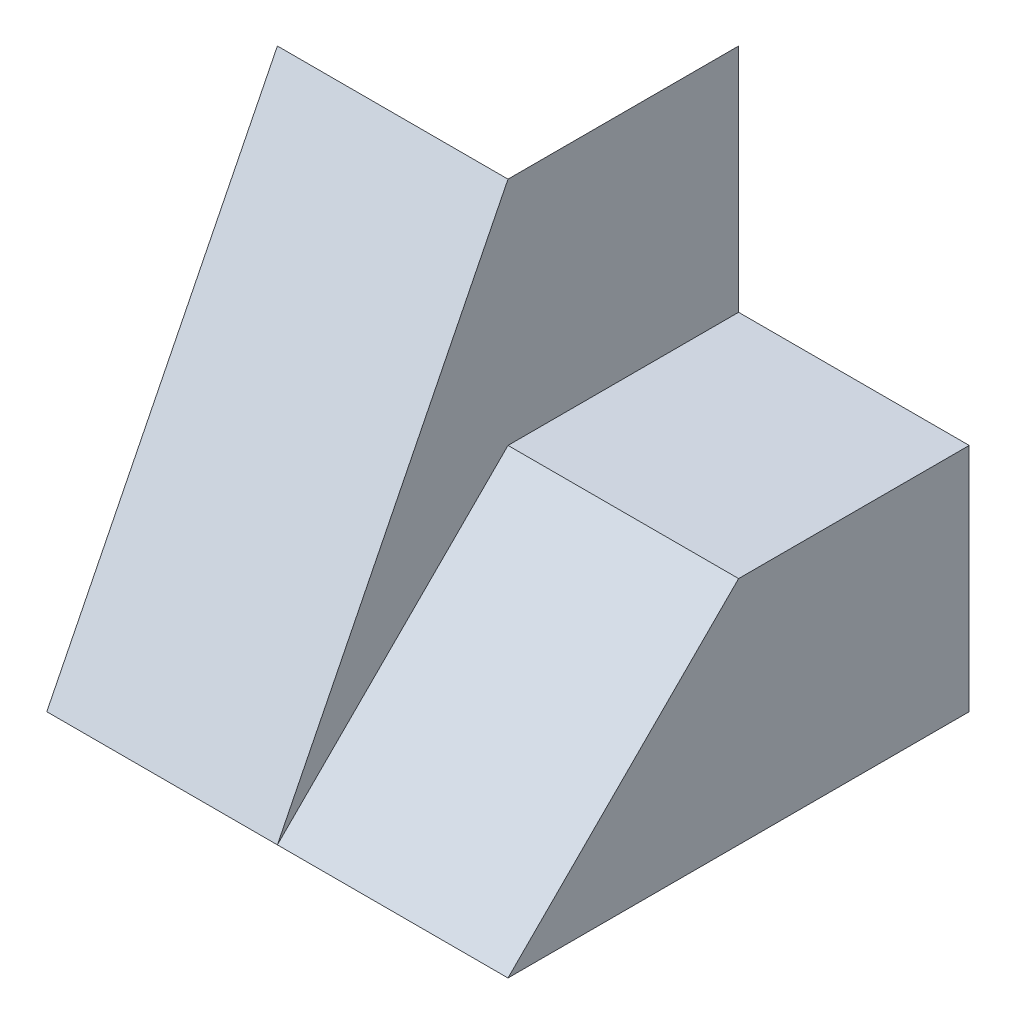
ISO-10303-21;
HEADER;
FILE_DESCRIPTION(('STEP AP214'),'2;1');
FILE_NAME('part.step','',(''),(''),'','','');
FILE_SCHEMA(('AUTOMOTIVE_DESIGN { 1 0 10303 214 1 1 1 1 }'));
ENDSEC;
DATA;
#1=APPLICATION_CONTEXT('core data for automotive mechanical design processes');
#2=APPLICATION_PROTOCOL_DEFINITION('international standard','automotive_design',2000,#1);
#3=PRODUCT_CONTEXT('',#1,'mechanical');
#4=PRODUCT('Part','Part','',(#3));
#5=PRODUCT_RELATED_PRODUCT_CATEGORY('part','',(#4));
#6=PRODUCT_DEFINITION_FORMATION('','',#4);
#7=PRODUCT_DEFINITION_CONTEXT('part definition',#1,'design');
#8=PRODUCT_DEFINITION('design','',#6,#7);
#9=PRODUCT_DEFINITION_SHAPE('','',#8);
#10=(LENGTH_UNIT() NAMED_UNIT(*) SI_UNIT(.MILLI.,.METRE.));
#11=(NAMED_UNIT(*) PLANE_ANGLE_UNIT() SI_UNIT($,.RADIAN.));
#12=(NAMED_UNIT(*) SI_UNIT($,.STERADIAN.) SOLID_ANGLE_UNIT());
#13=UNCERTAINTY_MEASURE_WITH_UNIT(LENGTH_MEASURE(1.E-05),#10,'distance_accuracy_value','');
#14=(GEOMETRIC_REPRESENTATION_CONTEXT(3) GLOBAL_UNCERTAINTY_ASSIGNED_CONTEXT((#13)) GLOBAL_UNIT_ASSIGNED_CONTEXT((#10,
#11,#12)) REPRESENTATION_CONTEXT('',''));
#15=CARTESIAN_POINT('',(0.,0.,0.));
#16=DIRECTION('',(0.,0.,1.));
#17=DIRECTION('',(1.,0.,0.));
#18=AXIS2_PLACEMENT_3D('',#15,#16,#17);
#19=CARTESIAN_POINT('',(0.,0.,40.));
#20=DIRECTION('',(1.,0.,0.));
#21=DIRECTION('',(0.,0.,-1.));
#22=AXIS2_PLACEMENT_3D('',#19,#20,#21);
#23=PLANE('',#22);
#24=DIRECTION('',(0.,0.,-1.));
#25=VECTOR('',#24,1.);
#26=CARTESIAN_POINT('',(0.,0.,40.));
#27=LINE('',#26,#25);
#28=CARTESIAN_POINT('',(0.,0.,40.));
#29=VERTEX_POINT('',#28);
#30=CARTESIAN_POINT('',(0.,0.,0.));
#31=VERTEX_POINT('',#30);
#32=EDGE_CURVE('E11',#29,#31,#27,.T.);
#33=ORIENTED_EDGE('',*,*,#32,.F.);
#34=DIRECTION('',(0.,-0.894427190999916,0.447213595499958));
#35=VECTOR('',#34,1.);
#36=CARTESIAN_POINT('',(0.,40.,20.));
#37=LINE('',#36,#35);
#38=CARTESIAN_POINT('',(0.,40.,20.));
#39=VERTEX_POINT('',#38);
#40=EDGE_CURVE('E93',#39,#29,#37,.T.);
#41=ORIENTED_EDGE('',*,*,#40,.F.);
#42=DIRECTION('',(0.,1.,0.));
#43=VECTOR('',#42,1.);
#44=CARTESIAN_POINT('',(0.,40.,20.));
#45=LINE('',#44,#43);
#46=CARTESIAN_POINT('',(0.,20.,20.));
#47=VERTEX_POINT('',#46);
#48=EDGE_CURVE('E173',#47,#39,#45,.T.);
#49=ORIENTED_EDGE('',*,*,#48,.F.);
#50=DIRECTION('',(0.,0.,-1.));
#51=VECTOR('',#50,1.);
#52=CARTESIAN_POINT('',(0.,20.,20.));
#53=LINE('',#52,#51);
#54=CARTESIAN_POINT('',(0.,20.,0.));
#55=VERTEX_POINT('',#54);
#56=EDGE_CURVE('E165',#47,#55,#53,.T.);
#57=ORIENTED_EDGE('',*,*,#56,.T.);
#58=DIRECTION('',(0.,-1.,0.));
#59=VECTOR('',#58,1.);
#60=CARTESIAN_POINT('',(0.,0.,0.));
#61=LINE('',#60,#59);
#62=EDGE_CURVE('E130',#55,#31,#61,.T.);
#63=ORIENTED_EDGE('',*,*,#62,.T.);
#64=EDGE_LOOP('',(#33,#41,#49,#57,#63));
#65=FACE_BOUND('',#64,.T.);
#66=ADVANCED_FACE('F33',(#65),#23,.F.);
#67=CARTESIAN_POINT('',(0.,0.,40.));
#68=DIRECTION('',(0.,1.,0.));
#69=DIRECTION('',(0.,0.,1.));
#70=AXIS2_PLACEMENT_3D('',#67,#68,#69);
#71=PLANE('',#70);
#72=DIRECTION('',(1.,0.,0.));
#73=VECTOR('',#72,1.);
#74=CARTESIAN_POINT('',(0.,0.,0.));
#75=LINE('',#74,#73);
#76=CARTESIAN_POINT('',(40.,0.,0.));
#77=VERTEX_POINT('',#76);
#78=EDGE_CURVE('E135',#31,#77,#75,.T.);
#79=ORIENTED_EDGE('',*,*,#78,.T.);
#80=DIRECTION('',(0.,0.,-1.));
#81=VECTOR('',#80,1.);
#82=CARTESIAN_POINT('',(40.,0.,40.));
#83=LINE('',#82,#81);
#84=CARTESIAN_POINT('',(40.,0.,40.));
#85=VERTEX_POINT('',#84);
#86=EDGE_CURVE('E40',#85,#77,#83,.T.);
#87=ORIENTED_EDGE('',*,*,#86,.F.);
#88=DIRECTION('',(1.,0.,0.));
#89=VECTOR('',#88,1.);
#90=CARTESIAN_POINT('',(20.,0.,40.));
#91=LINE('',#90,#89);
#92=CARTESIAN_POINT('',(20.,0.,40.));
#93=VERTEX_POINT('',#92);
#94=EDGE_CURVE('E107',#93,#85,#91,.T.);
#95=ORIENTED_EDGE('',*,*,#94,.F.);
#96=DIRECTION('',(1.,0.,0.));
#97=VECTOR('',#96,1.);
#98=CARTESIAN_POINT('',(0.,0.,40.));
#99=LINE('',#98,#97);
#100=EDGE_CURVE('E90',#29,#93,#99,.T.);
#101=ORIENTED_EDGE('',*,*,#100,.F.);
#102=ORIENTED_EDGE('',*,*,#32,.T.);
#103=EDGE_LOOP('',(#79,#87,#95,#101,#102));
#104=FACE_BOUND('',#103,.T.);
#105=ADVANCED_FACE('F115',(#104),#71,.F.);
#106=CARTESIAN_POINT('',(40.,0.,40.));
#107=DIRECTION('',(-1.,0.,0.));
#108=DIRECTION('',(0.,0.,1.));
#109=AXIS2_PLACEMENT_3D('',#106,#107,#108);
#110=PLANE('',#109);
#111=DIRECTION('',(0.,0.,1.));
#112=VECTOR('',#111,1.);
#113=CARTESIAN_POINT('',(40.,20.,0.));
#114=LINE('',#113,#112);
#115=CARTESIAN_POINT('',(40.,20.,0.));
#116=VERTEX_POINT('',#115);
#117=CARTESIAN_POINT('',(40.,20.,20.));
#118=VERTEX_POINT('',#117);
#119=EDGE_CURVE('E127',#116,#118,#114,.T.);
#120=ORIENTED_EDGE('',*,*,#119,.T.);
#121=DIRECTION('',(0.,0.707106781186548,-0.707106781186548));
#122=VECTOR('',#121,1.);
#123=CARTESIAN_POINT('',(40.,0.,40.));
#124=LINE('',#123,#122);
#125=EDGE_CURVE('E112',#85,#118,#124,.T.);
#126=ORIENTED_EDGE('',*,*,#125,.F.);
#127=ORIENTED_EDGE('',*,*,#86,.T.);
#128=DIRECTION('',(0.,1.,0.));
#129=VECTOR('',#128,1.);
#130=CARTESIAN_POINT('',(40.,0.,0.));
#131=LINE('',#130,#129);
#132=EDGE_CURVE('E97',#77,#116,#131,.T.);
#133=ORIENTED_EDGE('',*,*,#132,.T.);
#134=EDGE_LOOP('',(#120,#126,#127,#133));
#135=FACE_BOUND('',#134,.T.);
#136=ADVANCED_FACE('F140',(#135),#110,.F.);
#137=CARTESIAN_POINT('',(0.,0.,0.));
#138=DIRECTION('',(0.,0.,-1.));
#139=DIRECTION('',(-1.,0.,0.));
#140=AXIS2_PLACEMENT_3D('',#137,#138,#139);
#141=PLANE('',#140);
#142=DIRECTION('',(-0.707106781186548,-0.707106781186548,0.));
#143=VECTOR('',#142,1.);
#144=CARTESIAN_POINT('',(20.,40.,0.));
#145=LINE('',#144,#143);
#146=CARTESIAN_POINT('',(20.,40.,0.));
#147=VERTEX_POINT('',#146);
#148=EDGE_CURVE('E103',#147,#55,#145,.T.);
#149=ORIENTED_EDGE('',*,*,#148,.F.);
#150=DIRECTION('',(0.,-1.,0.));
#151=VECTOR('',#150,1.);
#152=CARTESIAN_POINT('',(20.,40.,0.));
#153=LINE('',#152,#151);
#154=CARTESIAN_POINT('',(20.,20.,0.));
#155=VERTEX_POINT('',#154);
#156=EDGE_CURVE('E118',#147,#155,#153,.T.);
#157=ORIENTED_EDGE('',*,*,#156,.T.);
#158=DIRECTION('',(1.,0.,0.));
#159=VECTOR('',#158,1.);
#160=CARTESIAN_POINT('',(40.,20.,0.));
#161=LINE('',#160,#159);
#162=EDGE_CURVE('E124',#155,#116,#161,.T.);
#163=ORIENTED_EDGE('',*,*,#162,.T.);
#164=ORIENTED_EDGE('',*,*,#132,.F.);
#165=ORIENTED_EDGE('',*,*,#78,.F.);
#166=ORIENTED_EDGE('',*,*,#62,.F.);
#167=EDGE_LOOP('',(#149,#157,#163,#164,#165,#166));
#168=FACE_BOUND('',#167,.T.);
#169=ADVANCED_FACE('F144',(#168),#141,.T.);
#170=CARTESIAN_POINT('',(40.,20.,0.));
#171=DIRECTION('',(0.,-1.,0.));
#172=DIRECTION('',(1.,0.,0.));
#173=AXIS2_PLACEMENT_3D('',#170,#171,#172);
#174=PLANE('',#173);
#175=DIRECTION('',(0.,0.,1.));
#176=VECTOR('',#175,1.);
#177=CARTESIAN_POINT('',(20.,20.,0.));
#178=LINE('',#177,#176);
#179=CARTESIAN_POINT('',(20.,20.,20.));
#180=VERTEX_POINT('',#179);
#181=EDGE_CURVE('E131',#155,#180,#178,.T.);
#182=ORIENTED_EDGE('',*,*,#181,.T.);
#183=DIRECTION('',(1.,0.,0.));
#184=VECTOR('',#183,1.);
#185=CARTESIAN_POINT('',(20.,20.,20.));
#186=LINE('',#185,#184);
#187=EDGE_CURVE('E110',#180,#118,#186,.T.);
#188=ORIENTED_EDGE('',*,*,#187,.T.);
#189=ORIENTED_EDGE('',*,*,#119,.F.);
#190=ORIENTED_EDGE('',*,*,#162,.F.);
#191=EDGE_LOOP('',(#182,#188,#189,#190));
#192=FACE_BOUND('',#191,.T.);
#193=ADVANCED_FACE('F147',(#192),#174,.F.);
#194=CARTESIAN_POINT('',(20.,40.,0.));
#195=DIRECTION('',(-1.,0.,0.));
#196=DIRECTION('',(0.,-1.,0.));
#197=AXIS2_PLACEMENT_3D('',#194,#195,#196);
#198=PLANE('',#197);
#199=DIRECTION('',(0.,0.,1.));
#200=VECTOR('',#199,1.);
#201=CARTESIAN_POINT('',(20.,40.,0.));
#202=LINE('',#201,#200);
#203=CARTESIAN_POINT('',(20.,40.,20.));
#204=VERTEX_POINT('',#203);
#205=EDGE_CURVE('E102',#147,#204,#202,.T.);
#206=ORIENTED_EDGE('',*,*,#205,.T.);
#207=DIRECTION('',(0.,-0.894427190999916,0.447213595499958));
#208=VECTOR('',#207,1.);
#209=CARTESIAN_POINT('',(20.,40.,20.));
#210=LINE('',#209,#208);
#211=EDGE_CURVE('E47',#204,#93,#210,.T.);
#212=ORIENTED_EDGE('',*,*,#211,.T.);
#213=DIRECTION('',(0.,0.707106781186548,-0.707106781186548));
#214=VECTOR('',#213,1.);
#215=CARTESIAN_POINT('',(20.,0.,40.));
#216=LINE('',#215,#214);
#217=EDGE_CURVE('E54',#93,#180,#216,.T.);
#218=ORIENTED_EDGE('',*,*,#217,.T.);
#219=ORIENTED_EDGE('',*,*,#181,.F.);
#220=ORIENTED_EDGE('',*,*,#156,.F.);
#221=EDGE_LOOP('',(#206,#212,#218,#219,#220));
#222=FACE_BOUND('',#221,.T.);
#223=ADVANCED_FACE('F100',(#222),#198,.F.);
#224=CARTESIAN_POINT('',(20.,0.,40.));
#225=DIRECTION('',(0.,-0.707106781186548,-0.707106781186548));
#226=DIRECTION('',(0.,0.707106781186548,-0.707106781186548));
#227=AXIS2_PLACEMENT_3D('',#224,#225,#226);
#228=PLANE('',#227);
#229=ORIENTED_EDGE('',*,*,#125,.T.);
#230=ORIENTED_EDGE('',*,*,#187,.F.);
#231=ORIENTED_EDGE('',*,*,#217,.F.);
#232=ORIENTED_EDGE('',*,*,#94,.T.);
#233=EDGE_LOOP('',(#229,#230,#231,#232));
#234=FACE_BOUND('',#233,.T.);
#235=ADVANCED_FACE('F106',(#234),#228,.F.);
#236=CARTESIAN_POINT('',(20.,40.,20.));
#237=DIRECTION('',(0.707106781186548,-0.707106781186548,0.));
#238=DIRECTION('',(0.707106781186548,0.707106781186548,0.));
#239=AXIS2_PLACEMENT_3D('',#236,#237,#238);
#240=PLANE('',#239);
#241=ORIENTED_EDGE('',*,*,#148,.T.);
#242=ORIENTED_EDGE('',*,*,#56,.F.);
#243=DIRECTION('',(-0.707106781186548,-0.707106781186548,0.));
#244=VECTOR('',#243,1.);
#245=CARTESIAN_POINT('',(20.,40.,20.));
#246=LINE('',#245,#244);
#247=EDGE_CURVE('E169',#204,#47,#246,.T.);
#248=ORIENTED_EDGE('',*,*,#247,.F.);
#249=ORIENTED_EDGE('',*,*,#205,.F.);
#250=EDGE_LOOP('',(#241,#242,#248,#249));
#251=FACE_BOUND('',#250,.T.);
#252=ADVANCED_FACE('F180',(#251),#240,.F.);
#253=CARTESIAN_POINT('',(0.,0.,20.));
#254=DIRECTION('',(0.,0.,1.));
#255=DIRECTION('',(1.,0.,0.));
#256=AXIS2_PLACEMENT_3D('',#253,#254,#255);
#257=PLANE('',#256);
#258=DIRECTION('',(1.,0.,0.));
#259=VECTOR('',#258,1.);
#260=CARTESIAN_POINT('',(20.,40.,20.));
#261=LINE('',#260,#259);
#262=EDGE_CURVE('E167',#39,#204,#261,.T.);
#263=ORIENTED_EDGE('',*,*,#262,.T.);
#264=ORIENTED_EDGE('',*,*,#247,.T.);
#265=ORIENTED_EDGE('',*,*,#48,.T.);
#266=EDGE_LOOP('',(#263,#264,#265));
#267=FACE_BOUND('',#266,.T.);
#268=ADVANCED_FACE('F179',(#267),#257,.F.);
#269=CARTESIAN_POINT('',(20.,40.,20.));
#270=DIRECTION('',(0.,-0.447213595499958,-0.894427190999916));
#271=DIRECTION('',(0.,0.894427190999916,-0.447213595499958));
#272=AXIS2_PLACEMENT_3D('',#269,#270,#271);
#273=PLANE('',#272);
#274=ORIENTED_EDGE('',*,*,#40,.T.);
#275=ORIENTED_EDGE('',*,*,#100,.T.);
#276=ORIENTED_EDGE('',*,*,#211,.F.);
#277=ORIENTED_EDGE('',*,*,#262,.F.);
#278=EDGE_LOOP('',(#274,#275,#276,#277));
#279=FACE_BOUND('',#278,.T.);
#280=ADVANCED_FACE('F91',(#279),#273,.F.);
#281=CLOSED_SHELL('',(#66,#105,#136,#169,#193,#223,#235,#252,#268,#280));
#282=MANIFOLD_SOLID_BREP('B2',#281);
#283=ADVANCED_BREP_SHAPE_REPRESENTATION('',(#18,#282),#14);
#284=SHAPE_DEFINITION_REPRESENTATION(#9,#283);
ENDSEC;
END-ISO-10303-21;
